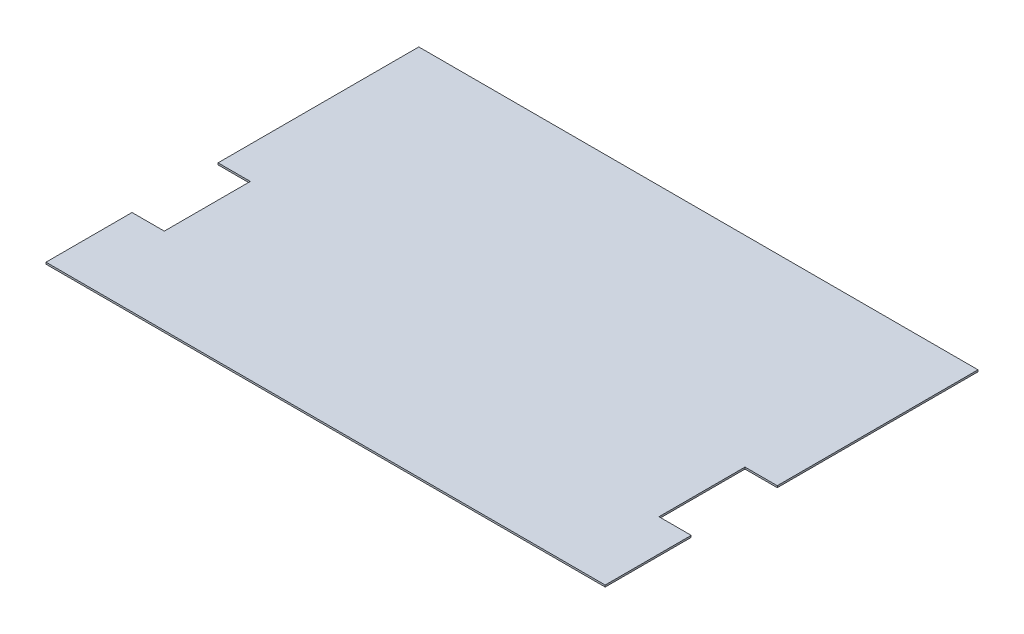
ISO-10303-21;
HEADER;
FILE_DESCRIPTION(('STEP AP214'),'2;1');
FILE_NAME('part.step','',(''),(''),'','','');
FILE_SCHEMA(('AUTOMOTIVE_DESIGN { 1 0 10303 214 1 1 1 1 }'));
ENDSEC;
DATA;
#1=APPLICATION_CONTEXT('core data for automotive mechanical design processes');
#2=APPLICATION_PROTOCOL_DEFINITION('international standard','automotive_design',2000,#1);
#3=PRODUCT_CONTEXT('',#1,'mechanical');
#4=PRODUCT('Part','Part','',(#3));
#5=PRODUCT_RELATED_PRODUCT_CATEGORY('part','',(#4));
#6=PRODUCT_DEFINITION_FORMATION('','',#4);
#7=PRODUCT_DEFINITION_CONTEXT('part definition',#1,'design');
#8=PRODUCT_DEFINITION('design','',#6,#7);
#9=PRODUCT_DEFINITION_SHAPE('','',#8);
#10=(LENGTH_UNIT() NAMED_UNIT(*) SI_UNIT(.MILLI.,.METRE.));
#11=(NAMED_UNIT(*) PLANE_ANGLE_UNIT() SI_UNIT($,.RADIAN.));
#12=(NAMED_UNIT(*) SI_UNIT($,.STERADIAN.) SOLID_ANGLE_UNIT());
#13=UNCERTAINTY_MEASURE_WITH_UNIT(LENGTH_MEASURE(1.E-05),#10,'distance_accuracy_value','');
#14=(GEOMETRIC_REPRESENTATION_CONTEXT(3) GLOBAL_UNCERTAINTY_ASSIGNED_CONTEXT((#13)) GLOBAL_UNIT_ASSIGNED_CONTEXT((#10,
#11,#12)) REPRESENTATION_CONTEXT('',''));
#15=CARTESIAN_POINT('',(0.,0.,0.));
#16=DIRECTION('',(0.,0.,1.));
#17=DIRECTION('',(1.,0.,0.));
#18=AXIS2_PLACEMENT_3D('',#15,#16,#17);
#19=CARTESIAN_POINT('',(247.65,-1.5875,-88.9));
#20=DIRECTION('',(1.,0.,0.));
#21=DIRECTION('',(0.,0.,-1.));
#22=AXIS2_PLACEMENT_3D('',#19,#20,#21);
#23=PLANE('',#22);
#24=DIRECTION('',(0.,0.,-1.));
#25=VECTOR('',#24,1.);
#26=CARTESIAN_POINT('',(247.65,0.,-88.9));
#27=LINE('',#26,#25);
#28=CARTESIAN_POINT('',(247.65,0.,88.9));
#29=VERTEX_POINT('',#28);
#30=CARTESIAN_POINT('',(247.65,0.,-88.9));
#31=VERTEX_POINT('',#30);
#32=EDGE_CURVE('E159',#29,#31,#27,.T.);
#33=ORIENTED_EDGE('',*,*,#32,.F.);
#34=DIRECTION('',(0.,1.,0.));
#35=VECTOR('',#34,1.);
#36=CARTESIAN_POINT('',(247.65,-1.5875,88.9));
#37=LINE('',#36,#35);
#38=CARTESIAN_POINT('',(247.65,-1.5875,88.9));
#39=VERTEX_POINT('',#38);
#40=EDGE_CURVE('E11',#39,#29,#37,.T.);
#41=ORIENTED_EDGE('',*,*,#40,.F.);
#42=DIRECTION('',(0.,0.,-1.));
#43=VECTOR('',#42,1.);
#44=CARTESIAN_POINT('',(247.65,-1.5875,-88.9));
#45=LINE('',#44,#43);
#46=CARTESIAN_POINT('',(247.65,-1.5875,-88.9));
#47=VERTEX_POINT('',#46);
#48=EDGE_CURVE('E191',#39,#47,#45,.T.);
#49=ORIENTED_EDGE('',*,*,#48,.T.);
#50=DIRECTION('',(0.,1.,0.));
#51=VECTOR('',#50,1.);
#52=CARTESIAN_POINT('',(247.65,-1.5875,-88.9));
#53=LINE('',#52,#51);
#54=EDGE_CURVE('E41',#47,#31,#53,.T.);
#55=ORIENTED_EDGE('',*,*,#54,.T.);
#56=EDGE_LOOP('',(#33,#41,#49,#55));
#57=FACE_BOUND('',#56,.T.);
#58=ADVANCED_FACE('F38',(#57),#23,.T.);
#59=CARTESIAN_POINT('',(219.075,-1.5875,88.9));
#60=DIRECTION('',(0.,0.,1.));
#61=DIRECTION('',(1.,0.,0.));
#62=AXIS2_PLACEMENT_3D('',#59,#60,#61);
#63=PLANE('',#62);
#64=DIRECTION('',(1.,0.,0.));
#65=VECTOR('',#64,1.);
#66=CARTESIAN_POINT('',(219.075,0.,88.9));
#67=LINE('',#66,#65);
#68=CARTESIAN_POINT('',(219.075,0.,88.9));
#69=VERTEX_POINT('',#68);
#70=EDGE_CURVE('E189',#69,#29,#67,.T.);
#71=ORIENTED_EDGE('',*,*,#70,.F.);
#72=DIRECTION('',(0.,1.,0.));
#73=VECTOR('',#72,1.);
#74=CARTESIAN_POINT('',(219.075,-1.5875,88.9));
#75=LINE('',#74,#73);
#76=CARTESIAN_POINT('',(219.075,-1.5875,88.9));
#77=VERTEX_POINT('',#76);
#78=EDGE_CURVE('E47',#77,#69,#75,.T.);
#79=ORIENTED_EDGE('',*,*,#78,.F.);
#80=DIRECTION('',(1.,0.,0.));
#81=VECTOR('',#80,1.);
#82=CARTESIAN_POINT('',(219.075,-1.5875,88.9));
#83=LINE('',#82,#81);
#84=EDGE_CURVE('E149',#77,#39,#83,.T.);
#85=ORIENTED_EDGE('',*,*,#84,.T.);
#86=ORIENTED_EDGE('',*,*,#40,.T.);
#87=EDGE_LOOP('',(#71,#79,#85,#86));
#88=FACE_BOUND('',#87,.T.);
#89=ADVANCED_FACE('F211',(#88),#63,.T.);
#90=CARTESIAN_POINT('',(219.075,-1.5875,88.9));
#91=DIRECTION('',(1.,0.,0.));
#92=DIRECTION('',(0.,0.,-1.));
#93=AXIS2_PLACEMENT_3D('',#90,#91,#92);
#94=PLANE('',#93);
#95=DIRECTION('',(0.,0.,-1.));
#96=VECTOR('',#95,1.);
#97=CARTESIAN_POINT('',(219.075,0.,88.9));
#98=LINE('',#97,#96);
#99=CARTESIAN_POINT('',(219.075,0.,165.1));
#100=VERTEX_POINT('',#99);
#101=EDGE_CURVE('E136',#100,#69,#98,.T.);
#102=ORIENTED_EDGE('',*,*,#101,.F.);
#103=DIRECTION('',(0.,1.,0.));
#104=VECTOR('',#103,1.);
#105=CARTESIAN_POINT('',(219.075,-1.5875,165.1));
#106=LINE('',#105,#104);
#107=CARTESIAN_POINT('',(219.075,-1.5875,165.1));
#108=VERTEX_POINT('',#107);
#109=EDGE_CURVE('E131',#108,#100,#106,.T.);
#110=ORIENTED_EDGE('',*,*,#109,.F.);
#111=DIRECTION('',(0.,0.,-1.));
#112=VECTOR('',#111,1.);
#113=CARTESIAN_POINT('',(219.075,-1.5875,88.9));
#114=LINE('',#113,#112);
#115=EDGE_CURVE('E134',#108,#77,#114,.T.);
#116=ORIENTED_EDGE('',*,*,#115,.T.);
#117=ORIENTED_EDGE('',*,*,#78,.T.);
#118=EDGE_LOOP('',(#102,#110,#116,#117));
#119=FACE_BOUND('',#118,.T.);
#120=ADVANCED_FACE('F133',(#119),#94,.T.);
#121=CARTESIAN_POINT('',(219.075,-1.5875,165.1));
#122=DIRECTION('',(0.,0.,-1.));
#123=DIRECTION('',(-1.,0.,0.));
#124=AXIS2_PLACEMENT_3D('',#121,#122,#123);
#125=PLANE('',#124);
#126=DIRECTION('',(-1.,0.,0.));
#127=VECTOR('',#126,1.);
#128=CARTESIAN_POINT('',(219.075,0.,165.1));
#129=LINE('',#128,#127);
#130=CARTESIAN_POINT('',(247.65,0.,165.1));
#131=VERTEX_POINT('',#130);
#132=EDGE_CURVE('E186',#131,#100,#129,.T.);
#133=ORIENTED_EDGE('',*,*,#132,.F.);
#134=DIRECTION('',(0.,1.,0.));
#135=VECTOR('',#134,1.);
#136=CARTESIAN_POINT('',(247.65,-1.5875,165.1));
#137=LINE('',#136,#135);
#138=CARTESIAN_POINT('',(247.65,-1.5875,165.1));
#139=VERTEX_POINT('',#138);
#140=EDGE_CURVE('E141',#139,#131,#137,.T.);
#141=ORIENTED_EDGE('',*,*,#140,.F.);
#142=DIRECTION('',(-1.,0.,0.));
#143=VECTOR('',#142,1.);
#144=CARTESIAN_POINT('',(219.075,-1.5875,165.1));
#145=LINE('',#144,#143);
#146=EDGE_CURVE('E147',#139,#108,#145,.T.);
#147=ORIENTED_EDGE('',*,*,#146,.T.);
#148=ORIENTED_EDGE('',*,*,#109,.T.);
#149=EDGE_LOOP('',(#133,#141,#147,#148));
#150=FACE_BOUND('',#149,.T.);
#151=ADVANCED_FACE('F151',(#150),#125,.T.);
#152=CARTESIAN_POINT('',(247.65,-1.5875,165.1));
#153=DIRECTION('',(1.,0.,0.));
#154=DIRECTION('',(0.,0.,-1.));
#155=AXIS2_PLACEMENT_3D('',#152,#153,#154);
#156=PLANE('',#155);
#157=DIRECTION('',(0.,0.,-1.));
#158=VECTOR('',#157,1.);
#159=CARTESIAN_POINT('',(247.65,0.,165.1));
#160=LINE('',#159,#158);
#161=CARTESIAN_POINT('',(247.65,0.,241.3));
#162=VERTEX_POINT('',#161);
#163=EDGE_CURVE('E183',#162,#131,#160,.T.);
#164=ORIENTED_EDGE('',*,*,#163,.F.);
#165=DIRECTION('',(0.,1.,0.));
#166=VECTOR('',#165,1.);
#167=CARTESIAN_POINT('',(247.65,-1.5875,241.3));
#168=LINE('',#167,#166);
#169=CARTESIAN_POINT('',(247.65,-1.5875,241.3));
#170=VERTEX_POINT('',#169);
#171=EDGE_CURVE('E195',#170,#162,#168,.T.);
#172=ORIENTED_EDGE('',*,*,#171,.F.);
#173=DIRECTION('',(0.,0.,-1.));
#174=VECTOR('',#173,1.);
#175=CARTESIAN_POINT('',(247.65,-1.5875,165.1));
#176=LINE('',#175,#174);
#177=EDGE_CURVE('E152',#170,#139,#176,.T.);
#178=ORIENTED_EDGE('',*,*,#177,.T.);
#179=ORIENTED_EDGE('',*,*,#140,.T.);
#180=EDGE_LOOP('',(#164,#172,#178,#179));
#181=FACE_BOUND('',#180,.T.);
#182=ADVANCED_FACE('F224',(#181),#156,.T.);
#183=CARTESIAN_POINT('',(-247.65,-1.5875,241.3));
#184=DIRECTION('',(0.,0.,1.));
#185=DIRECTION('',(1.,0.,0.));
#186=AXIS2_PLACEMENT_3D('',#183,#184,#185);
#187=PLANE('',#186);
#188=DIRECTION('',(1.,0.,0.));
#189=VECTOR('',#188,1.);
#190=CARTESIAN_POINT('',(-247.65,0.,241.3));
#191=LINE('',#190,#189);
#192=CARTESIAN_POINT('',(-247.65,0.,241.3));
#193=VERTEX_POINT('',#192);
#194=EDGE_CURVE('E180',#193,#162,#191,.T.);
#195=ORIENTED_EDGE('',*,*,#194,.F.);
#196=DIRECTION('',(0.,1.,0.));
#197=VECTOR('',#196,1.);
#198=CARTESIAN_POINT('',(-247.65,-1.5875,241.3));
#199=LINE('',#198,#197);
#200=CARTESIAN_POINT('',(-247.65,-1.5875,241.3));
#201=VERTEX_POINT('',#200);
#202=EDGE_CURVE('E197',#201,#193,#199,.T.);
#203=ORIENTED_EDGE('',*,*,#202,.F.);
#204=DIRECTION('',(1.,0.,0.));
#205=VECTOR('',#204,1.);
#206=CARTESIAN_POINT('',(-247.65,-1.5875,241.3));
#207=LINE('',#206,#205);
#208=EDGE_CURVE('E154',#201,#170,#207,.T.);
#209=ORIENTED_EDGE('',*,*,#208,.T.);
#210=ORIENTED_EDGE('',*,*,#171,.T.);
#211=EDGE_LOOP('',(#195,#203,#209,#210));
#212=FACE_BOUND('',#211,.T.);
#213=ADVANCED_FACE('F227',(#212),#187,.T.);
#214=CARTESIAN_POINT('',(-247.65,-1.5875,165.1));
#215=DIRECTION('',(-1.,0.,0.));
#216=DIRECTION('',(0.,0.,1.));
#217=AXIS2_PLACEMENT_3D('',#214,#215,#216);
#218=PLANE('',#217);
#219=DIRECTION('',(0.,0.,1.));
#220=VECTOR('',#219,1.);
#221=CARTESIAN_POINT('',(-247.65,0.,165.1));
#222=LINE('',#221,#220);
#223=CARTESIAN_POINT('',(-247.65,0.,165.1));
#224=VERTEX_POINT('',#223);
#225=EDGE_CURVE('E177',#224,#193,#222,.T.);
#226=ORIENTED_EDGE('',*,*,#225,.F.);
#227=DIRECTION('',(0.,1.,0.));
#228=VECTOR('',#227,1.);
#229=CARTESIAN_POINT('',(-247.65,-1.5875,165.1));
#230=LINE('',#229,#228);
#231=CARTESIAN_POINT('',(-247.65,-1.5875,165.1));
#232=VERTEX_POINT('',#231);
#233=EDGE_CURVE('E199',#232,#224,#230,.T.);
#234=ORIENTED_EDGE('',*,*,#233,.F.);
#235=DIRECTION('',(0.,0.,1.));
#236=VECTOR('',#235,1.);
#237=CARTESIAN_POINT('',(-247.65,-1.5875,165.1));
#238=LINE('',#237,#236);
#239=EDGE_CURVE('E381',#232,#201,#238,.T.);
#240=ORIENTED_EDGE('',*,*,#239,.T.);
#241=ORIENTED_EDGE('',*,*,#202,.T.);
#242=EDGE_LOOP('',(#226,#234,#240,#241));
#243=FACE_BOUND('',#242,.T.);
#244=ADVANCED_FACE('F231',(#243),#218,.T.);
#245=CARTESIAN_POINT('',(-247.65,-1.5875,165.1));
#246=DIRECTION('',(0.,0.,-1.));
#247=DIRECTION('',(-1.,0.,0.));
#248=AXIS2_PLACEMENT_3D('',#245,#246,#247);
#249=PLANE('',#248);
#250=DIRECTION('',(-1.,0.,0.));
#251=VECTOR('',#250,1.);
#252=CARTESIAN_POINT('',(-247.65,0.,165.1));
#253=LINE('',#252,#251);
#254=CARTESIAN_POINT('',(-219.075,0.,165.1));
#255=VERTEX_POINT('',#254);
#256=EDGE_CURVE('E174',#255,#224,#253,.T.);
#257=ORIENTED_EDGE('',*,*,#256,.F.);
#258=DIRECTION('',(0.,1.,0.));
#259=VECTOR('',#258,1.);
#260=CARTESIAN_POINT('',(-219.075,-1.5875,165.1));
#261=LINE('',#260,#259);
#262=CARTESIAN_POINT('',(-219.075,-1.5875,165.1));
#263=VERTEX_POINT('',#262);
#264=EDGE_CURVE('E201',#263,#255,#261,.T.);
#265=ORIENTED_EDGE('',*,*,#264,.F.);
#266=DIRECTION('',(-1.,0.,0.));
#267=VECTOR('',#266,1.);
#268=CARTESIAN_POINT('',(-247.65,-1.5875,165.1));
#269=LINE('',#268,#267);
#270=EDGE_CURVE('E385',#263,#232,#269,.T.);
#271=ORIENTED_EDGE('',*,*,#270,.T.);
#272=ORIENTED_EDGE('',*,*,#233,.T.);
#273=EDGE_LOOP('',(#257,#265,#271,#272));
#274=FACE_BOUND('',#273,.T.);
#275=ADVANCED_FACE('F235',(#274),#249,.T.);
#276=CARTESIAN_POINT('',(-219.075,-1.5875,88.9000000000001));
#277=DIRECTION('',(-1.,0.,0.));
#278=DIRECTION('',(0.,0.,1.));
#279=AXIS2_PLACEMENT_3D('',#276,#277,#278);
#280=PLANE('',#279);
#281=DIRECTION('',(0.,0.,1.));
#282=VECTOR('',#281,1.);
#283=CARTESIAN_POINT('',(-219.075,0.,88.9000000000001));
#284=LINE('',#283,#282);
#285=CARTESIAN_POINT('',(-219.075,0.,88.9000000000001));
#286=VERTEX_POINT('',#285);
#287=EDGE_CURVE('E171',#286,#255,#284,.T.);
#288=ORIENTED_EDGE('',*,*,#287,.F.);
#289=DIRECTION('',(0.,1.,0.));
#290=VECTOR('',#289,1.);
#291=CARTESIAN_POINT('',(-219.075,-1.5875,88.9000000000001));
#292=LINE('',#291,#290);
#293=CARTESIAN_POINT('',(-219.075,-1.5875,88.9000000000001));
#294=VERTEX_POINT('',#293);
#295=EDGE_CURVE('E203',#294,#286,#292,.T.);
#296=ORIENTED_EDGE('',*,*,#295,.F.);
#297=DIRECTION('',(0.,0.,1.));
#298=VECTOR('',#297,1.);
#299=CARTESIAN_POINT('',(-219.075,-1.5875,88.9000000000001));
#300=LINE('',#299,#298);
#301=EDGE_CURVE('E374',#294,#263,#300,.T.);
#302=ORIENTED_EDGE('',*,*,#301,.T.);
#303=ORIENTED_EDGE('',*,*,#264,.T.);
#304=EDGE_LOOP('',(#288,#296,#302,#303));
#305=FACE_BOUND('',#304,.T.);
#306=ADVANCED_FACE('F239',(#305),#280,.T.);
#307=CARTESIAN_POINT('',(-247.65,-1.5875,88.9));
#308=DIRECTION('',(0.,0.,1.));
#309=DIRECTION('',(1.,0.,0.));
#310=AXIS2_PLACEMENT_3D('',#307,#308,#309);
#311=PLANE('',#310);
#312=DIRECTION('',(1.,0.,0.));
#313=VECTOR('',#312,1.);
#314=CARTESIAN_POINT('',(-247.65,0.,88.9));
#315=LINE('',#314,#313);
#316=CARTESIAN_POINT('',(-247.65,0.,88.9));
#317=VERTEX_POINT('',#316);
#318=EDGE_CURVE('E168',#317,#286,#315,.T.);
#319=ORIENTED_EDGE('',*,*,#318,.F.);
#320=DIRECTION('',(0.,1.,0.));
#321=VECTOR('',#320,1.);
#322=CARTESIAN_POINT('',(-247.65,-1.5875,88.9));
#323=LINE('',#322,#321);
#324=CARTESIAN_POINT('',(-247.65,-1.5875,88.9));
#325=VERTEX_POINT('',#324);
#326=EDGE_CURVE('E205',#325,#317,#323,.T.);
#327=ORIENTED_EDGE('',*,*,#326,.F.);
#328=DIRECTION('',(1.,0.,0.));
#329=VECTOR('',#328,1.);
#330=CARTESIAN_POINT('',(-247.65,-1.5875,88.9));
#331=LINE('',#330,#329);
#332=EDGE_CURVE('E370',#325,#294,#331,.T.);
#333=ORIENTED_EDGE('',*,*,#332,.T.);
#334=ORIENTED_EDGE('',*,*,#295,.T.);
#335=EDGE_LOOP('',(#319,#327,#333,#334));
#336=FACE_BOUND('',#335,.T.);
#337=ADVANCED_FACE('F243',(#336),#311,.T.);
#338=CARTESIAN_POINT('',(-247.65,-1.5875,-88.9));
#339=DIRECTION('',(-1.,0.,0.));
#340=DIRECTION('',(0.,0.,1.));
#341=AXIS2_PLACEMENT_3D('',#338,#339,#340);
#342=PLANE('',#341);
#343=DIRECTION('',(0.,0.,1.));
#344=VECTOR('',#343,1.);
#345=CARTESIAN_POINT('',(-247.65,0.,-88.9));
#346=LINE('',#345,#344);
#347=CARTESIAN_POINT('',(-247.65,0.,-88.9));
#348=VERTEX_POINT('',#347);
#349=EDGE_CURVE('E165',#348,#317,#346,.T.);
#350=ORIENTED_EDGE('',*,*,#349,.F.);
#351=DIRECTION('',(0.,1.,0.));
#352=VECTOR('',#351,1.);
#353=CARTESIAN_POINT('',(-247.65,-1.5875,-88.9));
#354=LINE('',#353,#352);
#355=CARTESIAN_POINT('',(-247.65,-1.5875,-88.9));
#356=VERTEX_POINT('',#355);
#357=EDGE_CURVE('E206',#356,#348,#354,.T.);
#358=ORIENTED_EDGE('',*,*,#357,.F.);
#359=DIRECTION('',(0.,0.,1.));
#360=VECTOR('',#359,1.);
#361=CARTESIAN_POINT('',(-247.65,-1.5875,-88.9));
#362=LINE('',#361,#360);
#363=EDGE_CURVE('E391',#356,#325,#362,.T.);
#364=ORIENTED_EDGE('',*,*,#363,.T.);
#365=ORIENTED_EDGE('',*,*,#326,.T.);
#366=EDGE_LOOP('',(#350,#358,#364,#365));
#367=FACE_BOUND('',#366,.T.);
#368=ADVANCED_FACE('F247',(#367),#342,.T.);
#369=CARTESIAN_POINT('',(-247.65,-1.5875,-88.9));
#370=DIRECTION('',(0.,0.,-1.));
#371=DIRECTION('',(-1.,0.,0.));
#372=AXIS2_PLACEMENT_3D('',#369,#370,#371);
#373=PLANE('',#372);
#374=DIRECTION('',(-1.,0.,0.));
#375=VECTOR('',#374,1.);
#376=CARTESIAN_POINT('',(-247.65,0.,-88.9));
#377=LINE('',#376,#375);
#378=EDGE_CURVE('E162',#31,#348,#377,.T.);
#379=ORIENTED_EDGE('',*,*,#378,.F.);
#380=ORIENTED_EDGE('',*,*,#54,.F.);
#381=DIRECTION('',(-1.,0.,0.));
#382=VECTOR('',#381,1.);
#383=CARTESIAN_POINT('',(-247.65,-1.5875,-88.9));
#384=LINE('',#383,#382);
#385=EDGE_CURVE('E393',#47,#356,#384,.T.);
#386=ORIENTED_EDGE('',*,*,#385,.T.);
#387=ORIENTED_EDGE('',*,*,#357,.T.);
#388=EDGE_LOOP('',(#379,#380,#386,#387));
#389=FACE_BOUND('',#388,.T.);
#390=ADVANCED_FACE('F208',(#389),#373,.T.);
#391=CARTESIAN_POINT('',(0.,-1.5875,0.));
#392=DIRECTION('',(0.,1.,0.));
#393=DIRECTION('',(0.,0.,1.));
#394=AXIS2_PLACEMENT_3D('',#391,#392,#393);
#395=PLANE('',#394);
#396=ORIENTED_EDGE('',*,*,#48,.F.);
#397=ORIENTED_EDGE('',*,*,#84,.F.);
#398=ORIENTED_EDGE('',*,*,#115,.F.);
#399=ORIENTED_EDGE('',*,*,#146,.F.);
#400=ORIENTED_EDGE('',*,*,#177,.F.);
#401=ORIENTED_EDGE('',*,*,#208,.F.);
#402=ORIENTED_EDGE('',*,*,#239,.F.);
#403=ORIENTED_EDGE('',*,*,#270,.F.);
#404=ORIENTED_EDGE('',*,*,#301,.F.);
#405=ORIENTED_EDGE('',*,*,#332,.F.);
#406=ORIENTED_EDGE('',*,*,#363,.F.);
#407=ORIENTED_EDGE('',*,*,#385,.F.);
#408=EDGE_LOOP('',(#396,#397,#398,#399,#400,#401,#402,#403,#404,#405,#406,#407));
#409=FACE_BOUND('',#408,.T.);
#410=ADVANCED_FACE('F145',(#409),#395,.F.);
#411=CARTESIAN_POINT('',(0.,0.,0.));
#412=DIRECTION('',(0.,1.,0.));
#413=DIRECTION('',(0.,0.,1.));
#414=AXIS2_PLACEMENT_3D('',#411,#412,#413);
#415=PLANE('',#414);
#416=ORIENTED_EDGE('',*,*,#32,.T.);
#417=ORIENTED_EDGE('',*,*,#378,.T.);
#418=ORIENTED_EDGE('',*,*,#349,.T.);
#419=ORIENTED_EDGE('',*,*,#318,.T.);
#420=ORIENTED_EDGE('',*,*,#287,.T.);
#421=ORIENTED_EDGE('',*,*,#256,.T.);
#422=ORIENTED_EDGE('',*,*,#225,.T.);
#423=ORIENTED_EDGE('',*,*,#194,.T.);
#424=ORIENTED_EDGE('',*,*,#163,.T.);
#425=ORIENTED_EDGE('',*,*,#132,.T.);
#426=ORIENTED_EDGE('',*,*,#101,.T.);
#427=ORIENTED_EDGE('',*,*,#70,.T.);
#428=EDGE_LOOP('',(#416,#417,#418,#419,#420,#421,#422,#423,#424,#425,#426,#427));
#429=FACE_BOUND('',#428,.T.);
#430=ADVANCED_FACE('F210',(#429),#415,.T.);
#431=CLOSED_SHELL('',(#58,#89,#120,#151,#182,#213,#244,#275,#306,#337,#368,#390,#410,#430));
#432=MANIFOLD_SOLID_BREP('B2',#431);
#433=ADVANCED_BREP_SHAPE_REPRESENTATION('',(#18,#432),#14);
#434=SHAPE_DEFINITION_REPRESENTATION(#9,#433);
ENDSEC;
END-ISO-10303-21;
